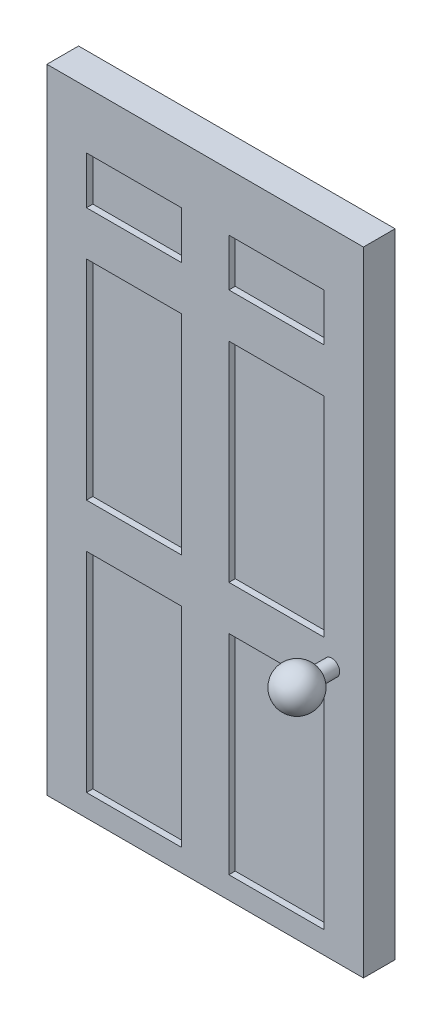
ISO-10303-21;
HEADER;
FILE_DESCRIPTION(('STEP AP214'),'2;1');
FILE_NAME('part.step','',(''),(''),'','','');
FILE_SCHEMA(('AUTOMOTIVE_DESIGN { 1 0 10303 214 1 1 1 1 }'));
ENDSEC;
DATA;
#1=APPLICATION_CONTEXT('core data for automotive mechanical design processes');
#2=APPLICATION_PROTOCOL_DEFINITION('international standard','automotive_design',2000,#1);
#3=PRODUCT_CONTEXT('',#1,'mechanical');
#4=PRODUCT('Part','Part','',(#3));
#5=PRODUCT_RELATED_PRODUCT_CATEGORY('part','',(#4));
#6=PRODUCT_DEFINITION_FORMATION('','',#4);
#7=PRODUCT_DEFINITION_CONTEXT('part definition',#1,'design');
#8=PRODUCT_DEFINITION('design','',#6,#7);
#9=PRODUCT_DEFINITION_SHAPE('','',#8);
#10=(LENGTH_UNIT() NAMED_UNIT(*) SI_UNIT(.MILLI.,.METRE.));
#11=(NAMED_UNIT(*) PLANE_ANGLE_UNIT() SI_UNIT($,.RADIAN.));
#12=(NAMED_UNIT(*) SI_UNIT($,.STERADIAN.) SOLID_ANGLE_UNIT());
#13=UNCERTAINTY_MEASURE_WITH_UNIT(LENGTH_MEASURE(1.E-05),#10,'distance_accuracy_value','');
#14=(GEOMETRIC_REPRESENTATION_CONTEXT(3) GLOBAL_UNCERTAINTY_ASSIGNED_CONTEXT((#13)) GLOBAL_UNIT_ASSIGNED_CONTEXT((#10,
#11,#12)) REPRESENTATION_CONTEXT('',''));
#15=CARTESIAN_POINT('',(0.,0.,0.));
#16=DIRECTION('',(0.,0.,1.));
#17=DIRECTION('',(1.,0.,0.));
#18=AXIS2_PLACEMENT_3D('',#15,#16,#17);
#19=CARTESIAN_POINT('',(25.,50.,2.5));
#20=DIRECTION('',(-1.,0.,0.));
#21=DIRECTION('',(0.,-1.,0.));
#22=AXIS2_PLACEMENT_3D('',#19,#20,#21);
#23=PLANE('',#22);
#24=DIRECTION('',(0.,1.,0.));
#25=VECTOR('',#24,1.);
#26=CARTESIAN_POINT('',(25.,50.,-2.5));
#27=LINE('',#26,#25);
#28=CARTESIAN_POINT('',(25.,-50.,-2.5));
#29=VERTEX_POINT('',#28);
#30=CARTESIAN_POINT('',(25.,50.,-2.5));
#31=VERTEX_POINT('',#30);
#32=EDGE_CURVE('E499',#29,#31,#27,.T.);
#33=ORIENTED_EDGE('',*,*,#32,.T.);
#34=DIRECTION('',(0.,0.,-1.));
#35=VECTOR('',#34,1.);
#36=CARTESIAN_POINT('',(25.,50.,2.5));
#37=LINE('',#36,#35);
#38=CARTESIAN_POINT('',(25.,50.,2.5));
#39=VERTEX_POINT('',#38);
#40=EDGE_CURVE('E11',#39,#31,#37,.T.);
#41=ORIENTED_EDGE('',*,*,#40,.F.);
#42=DIRECTION('',(0.,1.,0.));
#43=VECTOR('',#42,1.);
#44=CARTESIAN_POINT('',(25.,50.,2.5));
#45=LINE('',#44,#43);
#46=CARTESIAN_POINT('',(25.,-50.,2.5));
#47=VERTEX_POINT('',#46);
#48=EDGE_CURVE('E503',#47,#39,#45,.T.);
#49=ORIENTED_EDGE('',*,*,#48,.F.);
#50=DIRECTION('',(0.,0.,-1.));
#51=VECTOR('',#50,1.);
#52=CARTESIAN_POINT('',(25.,-50.,2.5));
#53=LINE('',#52,#51);
#54=EDGE_CURVE('E517',#47,#29,#53,.T.);
#55=ORIENTED_EDGE('',*,*,#54,.T.);
#56=EDGE_LOOP('',(#33,#41,#49,#55));
#57=FACE_BOUND('',#56,.T.);
#58=ADVANCED_FACE('F39',(#57),#23,.F.);
#59=CARTESIAN_POINT('',(-25.,50.,2.5));
#60=DIRECTION('',(0.,-1.,0.));
#61=DIRECTION('',(0.,0.,-1.));
#62=AXIS2_PLACEMENT_3D('',#59,#60,#61);
#63=PLANE('',#62);
#64=DIRECTION('',(-1.,0.,0.));
#65=VECTOR('',#64,1.);
#66=CARTESIAN_POINT('',(-25.,50.,-2.5));
#67=LINE('',#66,#65);
#68=CARTESIAN_POINT('',(-25.,50.,-2.5));
#69=VERTEX_POINT('',#68);
#70=EDGE_CURVE('E521',#31,#69,#67,.T.);
#71=ORIENTED_EDGE('',*,*,#70,.T.);
#72=DIRECTION('',(0.,0.,-1.));
#73=VECTOR('',#72,1.);
#74=CARTESIAN_POINT('',(-25.,50.,2.5));
#75=LINE('',#74,#73);
#76=CARTESIAN_POINT('',(-25.,50.,2.5));
#77=VERTEX_POINT('',#76);
#78=EDGE_CURVE('E47',#77,#69,#75,.T.);
#79=ORIENTED_EDGE('',*,*,#78,.F.);
#80=DIRECTION('',(-1.,0.,0.));
#81=VECTOR('',#80,1.);
#82=CARTESIAN_POINT('',(-25.,50.,2.5));
#83=LINE('',#82,#81);
#84=EDGE_CURVE('E507',#39,#77,#83,.T.);
#85=ORIENTED_EDGE('',*,*,#84,.F.);
#86=ORIENTED_EDGE('',*,*,#40,.T.);
#87=EDGE_LOOP('',(#71,#79,#85,#86));
#88=FACE_BOUND('',#87,.T.);
#89=ADVANCED_FACE('F557',(#88),#63,.F.);
#90=CARTESIAN_POINT('',(-25.,50.,2.5));
#91=DIRECTION('',(1.,0.,0.));
#92=DIRECTION('',(0.,1.,0.));
#93=AXIS2_PLACEMENT_3D('',#90,#91,#92);
#94=PLANE('',#93);
#95=DIRECTION('',(0.,-1.,0.));
#96=VECTOR('',#95,1.);
#97=CARTESIAN_POINT('',(-25.,50.,-2.5));
#98=LINE('',#97,#96);
#99=CARTESIAN_POINT('',(-25.,-50.,-2.5));
#100=VERTEX_POINT('',#99);
#101=EDGE_CURVE('E524',#69,#100,#98,.T.);
#102=ORIENTED_EDGE('',*,*,#101,.T.);
#103=DIRECTION('',(0.,0.,-1.));
#104=VECTOR('',#103,1.);
#105=CARTESIAN_POINT('',(-25.,-50.,2.5));
#106=LINE('',#105,#104);
#107=CARTESIAN_POINT('',(-25.,-50.,2.5));
#108=VERTEX_POINT('',#107);
#109=EDGE_CURVE('E532',#108,#100,#106,.T.);
#110=ORIENTED_EDGE('',*,*,#109,.F.);
#111=DIRECTION('',(0.,-1.,0.));
#112=VECTOR('',#111,1.);
#113=CARTESIAN_POINT('',(-25.,50.,2.5));
#114=LINE('',#113,#112);
#115=EDGE_CURVE('E511',#77,#108,#114,.T.);
#116=ORIENTED_EDGE('',*,*,#115,.F.);
#117=ORIENTED_EDGE('',*,*,#78,.T.);
#118=EDGE_LOOP('',(#102,#110,#116,#117));
#119=FACE_BOUND('',#118,.T.);
#120=ADVANCED_FACE('F541',(#119),#94,.F.);
#121=CARTESIAN_POINT('',(-25.,-50.,2.5));
#122=DIRECTION('',(0.,1.,0.));
#123=DIRECTION('',(0.,0.,1.));
#124=AXIS2_PLACEMENT_3D('',#121,#122,#123);
#125=PLANE('',#124);
#126=DIRECTION('',(1.,0.,0.));
#127=VECTOR('',#126,1.);
#128=CARTESIAN_POINT('',(-25.,-50.,-2.5));
#129=LINE('',#128,#127);
#130=EDGE_CURVE('E508',#100,#29,#129,.T.);
#131=ORIENTED_EDGE('',*,*,#130,.T.);
#132=ORIENTED_EDGE('',*,*,#54,.F.);
#133=DIRECTION('',(1.,0.,0.));
#134=VECTOR('',#133,1.);
#135=CARTESIAN_POINT('',(-25.,-50.,2.5));
#136=LINE('',#135,#134);
#137=EDGE_CURVE('E514',#108,#47,#136,.T.);
#138=ORIENTED_EDGE('',*,*,#137,.F.);
#139=ORIENTED_EDGE('',*,*,#109,.T.);
#140=EDGE_LOOP('',(#131,#132,#138,#139));
#141=FACE_BOUND('',#140,.T.);
#142=ADVANCED_FACE('F550',(#141),#125,.F.);
#143=CARTESIAN_POINT('',(0.,0.,2.5));
#144=DIRECTION('',(0.,0.,1.));
#145=DIRECTION('',(1.,0.,0.));
#146=AXIS2_PLACEMENT_3D('',#143,#144,#145);
#147=PLANE('',#146);
#148=DIRECTION('',(0.,-1.,0.));
#149=VECTOR('',#148,1.);
#150=CARTESIAN_POINT('',(3.74999999999998,41.,2.5));
#151=LINE('',#150,#149);
#152=CARTESIAN_POINT('',(3.74999999999998,41.,2.5));
#153=VERTEX_POINT('',#152);
#154=CARTESIAN_POINT('',(3.74999999999998,33.5,2.5));
#155=VERTEX_POINT('',#154);
#156=EDGE_CURVE('E54',#153,#155,#151,.T.);
#157=ORIENTED_EDGE('',*,*,#156,.F.);
#158=DIRECTION('',(-1.,0.,0.));
#159=VECTOR('',#158,1.);
#160=CARTESIAN_POINT('',(3.74999999999998,41.,2.5));
#161=LINE('',#160,#159);
#162=CARTESIAN_POINT('',(18.75,41.,2.5));
#163=VERTEX_POINT('',#162);
#164=EDGE_CURVE('E284',#163,#153,#161,.T.);
#165=ORIENTED_EDGE('',*,*,#164,.F.);
#166=DIRECTION('',(0.,1.,0.));
#167=VECTOR('',#166,1.);
#168=CARTESIAN_POINT('',(18.75,41.,2.5));
#169=LINE('',#168,#167);
#170=CARTESIAN_POINT('',(18.75,33.5,2.5));
#171=VERTEX_POINT('',#170);
#172=EDGE_CURVE('E304',#171,#163,#169,.T.);
#173=ORIENTED_EDGE('',*,*,#172,.F.);
#174=DIRECTION('',(1.,0.,0.));
#175=VECTOR('',#174,1.);
#176=CARTESIAN_POINT('',(3.74999999999998,33.5,2.5));
#177=LINE('',#176,#175);
#178=EDGE_CURVE('E299',#155,#171,#177,.T.);
#179=ORIENTED_EDGE('',*,*,#178,.F.);
#180=EDGE_LOOP('',(#157,#165,#173,#179));
#181=FACE_BOUND('',#180,.T.);
#182=DIRECTION('',(0.,-1.,0.));
#183=VECTOR('',#182,1.);
#184=CARTESIAN_POINT('',(3.74999999999999,26.5,2.5));
#185=LINE('',#184,#183);
#186=CARTESIAN_POINT('',(3.74999999999999,26.5,2.5));
#187=VERTEX_POINT('',#186);
#188=CARTESIAN_POINT('',(3.75,-6.5,2.5));
#189=VERTEX_POINT('',#188);
#190=EDGE_CURVE('E62',#187,#189,#185,.T.);
#191=ORIENTED_EDGE('',*,*,#190,.F.);
#192=DIRECTION('',(-1.,0.,0.));
#193=VECTOR('',#192,1.);
#194=CARTESIAN_POINT('',(3.74999999999999,26.5,2.5));
#195=LINE('',#194,#193);
#196=CARTESIAN_POINT('',(18.75,26.5,2.5));
#197=VERTEX_POINT('',#196);
#198=EDGE_CURVE('E328',#197,#187,#195,.T.);
#199=ORIENTED_EDGE('',*,*,#198,.F.);
#200=DIRECTION('',(0.,1.,0.));
#201=VECTOR('',#200,1.);
#202=CARTESIAN_POINT('',(18.75,26.5,2.5));
#203=LINE('',#202,#201);
#204=CARTESIAN_POINT('',(18.75,-6.49999999999999,2.5));
#205=VERTEX_POINT('',#204);
#206=EDGE_CURVE('E348',#205,#197,#203,.T.);
#207=ORIENTED_EDGE('',*,*,#206,.F.);
#208=DIRECTION('',(1.,0.,0.));
#209=VECTOR('',#208,1.);
#210=CARTESIAN_POINT('',(3.75,-6.5,2.5));
#211=LINE('',#210,#209);
#212=EDGE_CURVE('E343',#189,#205,#211,.T.);
#213=ORIENTED_EDGE('',*,*,#212,.F.);
#214=EDGE_LOOP('',(#191,#199,#207,#213));
#215=FACE_BOUND('',#214,.T.);
#216=DIRECTION('',(0.,1.,0.));
#217=VECTOR('',#216,1.);
#218=CARTESIAN_POINT('',(-3.75,26.5,2.5));
#219=LINE('',#218,#217);
#220=CARTESIAN_POINT('',(-3.75,-6.5,2.5));
#221=VERTEX_POINT('',#220);
#222=CARTESIAN_POINT('',(-3.75,26.5,2.5));
#223=VERTEX_POINT('',#222);
#224=EDGE_CURVE('E383',#221,#223,#219,.T.);
#225=ORIENTED_EDGE('',*,*,#224,.F.);
#226=DIRECTION('',(1.,0.,0.));
#227=VECTOR('',#226,1.);
#228=CARTESIAN_POINT('',(-3.75,-6.5,2.5));
#229=LINE('',#228,#227);
#230=CARTESIAN_POINT('',(-18.75,-6.50000000000001,2.5));
#231=VERTEX_POINT('',#230);
#232=EDGE_CURVE('E370',#231,#221,#229,.T.);
#233=ORIENTED_EDGE('',*,*,#232,.F.);
#234=DIRECTION('',(0.,-1.,0.));
#235=VECTOR('',#234,1.);
#236=CARTESIAN_POINT('',(-18.75,26.5,2.5));
#237=LINE('',#236,#235);
#238=CARTESIAN_POINT('',(-18.75,26.5,2.5));
#239=VERTEX_POINT('',#238);
#240=EDGE_CURVE('E391',#239,#231,#237,.T.);
#241=ORIENTED_EDGE('',*,*,#240,.F.);
#242=DIRECTION('',(-1.,0.,0.));
#243=VECTOR('',#242,1.);
#244=CARTESIAN_POINT('',(-3.75,26.5,2.5));
#245=LINE('',#244,#243);
#246=EDGE_CURVE('E386',#223,#239,#245,.T.);
#247=ORIENTED_EDGE('',*,*,#246,.F.);
#248=EDGE_LOOP('',(#225,#233,#241,#247));
#249=FACE_BOUND('',#248,.T.);
#250=DIRECTION('',(0.,1.,0.));
#251=VECTOR('',#250,1.);
#252=CARTESIAN_POINT('',(-3.75,-13.5,2.5));
#253=LINE('',#252,#251);
#254=CARTESIAN_POINT('',(-3.74999999999999,-46.5,2.5));
#255=VERTEX_POINT('',#254);
#256=CARTESIAN_POINT('',(-3.75,-13.5,2.5));
#257=VERTEX_POINT('',#256);
#258=EDGE_CURVE('E273',#255,#257,#253,.T.);
#259=ORIENTED_EDGE('',*,*,#258,.F.);
#260=DIRECTION('',(1.,0.,0.));
#261=VECTOR('',#260,1.);
#262=CARTESIAN_POINT('',(-3.74999999999999,-46.5,2.5));
#263=LINE('',#262,#261);
#264=CARTESIAN_POINT('',(-18.75,-46.5,2.5));
#265=VERTEX_POINT('',#264);
#266=EDGE_CURVE('E414',#265,#255,#263,.T.);
#267=ORIENTED_EDGE('',*,*,#266,.F.);
#268=DIRECTION('',(0.,-1.,0.));
#269=VECTOR('',#268,1.);
#270=CARTESIAN_POINT('',(-18.75,-13.5,2.5));
#271=LINE('',#270,#269);
#272=CARTESIAN_POINT('',(-18.75,-13.5,2.5));
#273=VERTEX_POINT('',#272);
#274=EDGE_CURVE('E433',#273,#265,#271,.T.);
#275=ORIENTED_EDGE('',*,*,#274,.F.);
#276=DIRECTION('',(-1.,0.,0.));
#277=VECTOR('',#276,1.);
#278=CARTESIAN_POINT('',(-3.75,-13.5,2.5));
#279=LINE('',#278,#277);
#280=EDGE_CURVE('E429',#257,#273,#279,.T.);
#281=ORIENTED_EDGE('',*,*,#280,.F.);
#282=EDGE_LOOP('',(#259,#267,#275,#281));
#283=FACE_BOUND('',#282,.T.);
#284=DIRECTION('',(0.,-1.,0.));
#285=VECTOR('',#284,1.);
#286=CARTESIAN_POINT('',(3.75000000000001,-13.5,2.5));
#287=LINE('',#286,#285);
#288=CARTESIAN_POINT('',(3.75000000000001,-13.5,2.5));
#289=VERTEX_POINT('',#288);
#290=CARTESIAN_POINT('',(3.75000000000002,-46.5,2.5));
#291=VERTEX_POINT('',#290);
#292=EDGE_CURVE('E231',#289,#291,#287,.T.);
#293=ORIENTED_EDGE('',*,*,#292,.F.);
#294=DIRECTION('',(-1.,0.,0.));
#295=VECTOR('',#294,1.);
#296=CARTESIAN_POINT('',(3.75000000000001,-13.5,2.5));
#297=LINE('',#296,#295);
#298=CARTESIAN_POINT('',(18.75,-13.5,2.5));
#299=VERTEX_POINT('',#298);
#300=EDGE_CURVE('E251',#299,#289,#297,.T.);
#301=ORIENTED_EDGE('',*,*,#300,.F.);
#302=DIRECTION('',(0.,1.,0.));
#303=VECTOR('',#302,1.);
#304=CARTESIAN_POINT('',(18.75,-13.5,2.5));
#305=LINE('',#304,#303);
#306=CARTESIAN_POINT('',(18.75,-46.5,2.5));
#307=VERTEX_POINT('',#306);
#308=EDGE_CURVE('E255',#307,#299,#305,.T.);
#309=ORIENTED_EDGE('',*,*,#308,.F.);
#310=DIRECTION('',(1.,0.,0.));
#311=VECTOR('',#310,1.);
#312=CARTESIAN_POINT('',(3.75000000000002,-46.5,2.5));
#313=LINE('',#312,#311);
#314=EDGE_CURVE('E264',#291,#307,#313,.T.);
#315=ORIENTED_EDGE('',*,*,#314,.F.);
#316=EDGE_LOOP('',(#293,#301,#309,#315));
#317=FACE_BOUND('',#316,.T.);
#318=DIRECTION('',(0.,1.,0.));
#319=VECTOR('',#318,1.);
#320=CARTESIAN_POINT('',(-3.75,41.,2.5));
#321=LINE('',#320,#319);
#322=CARTESIAN_POINT('',(-3.75,33.5,2.5));
#323=VERTEX_POINT('',#322);
#324=CARTESIAN_POINT('',(-3.75,41.,2.5));
#325=VERTEX_POINT('',#324);
#326=EDGE_CURVE('E314',#323,#325,#321,.T.);
#327=ORIENTED_EDGE('',*,*,#326,.F.);
#328=DIRECTION('',(1.,0.,0.));
#329=VECTOR('',#328,1.);
#330=CARTESIAN_POINT('',(-3.75,33.5,2.5));
#331=LINE('',#330,#329);
#332=CARTESIAN_POINT('',(-18.75,33.5,2.5));
#333=VERTEX_POINT('',#332);
#334=EDGE_CURVE('E456',#333,#323,#331,.T.);
#335=ORIENTED_EDGE('',*,*,#334,.F.);
#336=DIRECTION('',(0.,-1.,0.));
#337=VECTOR('',#336,1.);
#338=CARTESIAN_POINT('',(-18.75,41.,2.5));
#339=LINE('',#338,#337);
#340=CARTESIAN_POINT('',(-18.75,41.,2.5));
#341=VERTEX_POINT('',#340);
#342=EDGE_CURVE('E475',#341,#333,#339,.T.);
#343=ORIENTED_EDGE('',*,*,#342,.F.);
#344=DIRECTION('',(-1.,0.,0.));
#345=VECTOR('',#344,1.);
#346=CARTESIAN_POINT('',(-3.75,41.,2.5));
#347=LINE('',#346,#345);
#348=EDGE_CURVE('E471',#325,#341,#347,.T.);
#349=ORIENTED_EDGE('',*,*,#348,.F.);
#350=EDGE_LOOP('',(#327,#335,#343,#349));
#351=FACE_BOUND('',#350,.T.);
#352=CARTESIAN_POINT('',(20.,-10.,2.5));
#353=DIRECTION('',(0.,0.,1.));
#354=DIRECTION('',(1.,0.,0.));
#355=AXIS2_PLACEMENT_3D('',#352,#353,#354);
#356=CIRCLE('',#355,1.25);
#357=CARTESIAN_POINT('',(21.25,-10.,2.5));
#358=VERTEX_POINT('',#357);
#359=EDGE_CURVE('E485',#358,#358,#356,.T.);
#360=ORIENTED_EDGE('',*,*,#359,.F.);
#361=EDGE_LOOP('',(#360));
#362=FACE_BOUND('',#361,.T.);
#363=ORIENTED_EDGE('',*,*,#48,.T.);
#364=ORIENTED_EDGE('',*,*,#84,.T.);
#365=ORIENTED_EDGE('',*,*,#115,.T.);
#366=ORIENTED_EDGE('',*,*,#137,.T.);
#367=EDGE_LOOP('',(#363,#364,#365,#366));
#368=FACE_BOUND('',#367,.T.);
#369=ADVANCED_FACE('F556',(#181,#215,#249,#283,#317,#351,#362,#368),#147,.T.);
#370=CARTESIAN_POINT('',(0.,0.,-2.5));
#371=DIRECTION('',(0.,0.,1.));
#372=DIRECTION('',(1.,0.,0.));
#373=AXIS2_PLACEMENT_3D('',#370,#371,#372);
#374=PLANE('',#373);
#375=ORIENTED_EDGE('',*,*,#32,.F.);
#376=ORIENTED_EDGE('',*,*,#130,.F.);
#377=ORIENTED_EDGE('',*,*,#101,.F.);
#378=ORIENTED_EDGE('',*,*,#70,.F.);
#379=EDGE_LOOP('',(#375,#376,#377,#378));
#380=FACE_BOUND('',#379,.T.);
#381=ADVANCED_FACE('F547',(#380),#374,.F.);
#382=CARTESIAN_POINT('',(20.,-10.,5.));
#383=DIRECTION('',(0.,0.,-1.));
#384=DIRECTION('',(-1.,0.,0.));
#385=AXIS2_PLACEMENT_3D('',#382,#383,#384);
#386=CYLINDRICAL_SURFACE('',#385,1.25);
#387=CARTESIAN_POINT('',(20.,-10.,5.));
#388=DIRECTION('',(0.,0.,1.));
#389=DIRECTION('',(1.,0.,0.));
#390=AXIS2_PLACEMENT_3D('',#387,#388,#389);
#391=CIRCLE('',#390,1.25);
#392=CARTESIAN_POINT('',(21.25,-10.,5.));
#393=VERTEX_POINT('',#392);
#394=EDGE_CURVE('E495',#393,#393,#391,.T.);
#395=ORIENTED_EDGE('',*,*,#394,.F.);
#396=EDGE_LOOP('',(#395));
#397=FACE_BOUND('',#396,.T.);
#398=ORIENTED_EDGE('',*,*,#359,.T.);
#399=EDGE_LOOP('',(#398));
#400=FACE_BOUND('',#399,.T.);
#401=ADVANCED_FACE('F569',(#397,#400),#386,.T.);
#402=CARTESIAN_POINT('',(20.,-10.,8.));
#403=DIRECTION('',(0.,1.,0.));
#404=DIRECTION('',(0.,0.,1.));
#405=AXIS2_PLACEMENT_3D('',#402,#403,#404);
#406=SPHERICAL_SURFACE('',#405,3.25);
#407=CARTESIAN_POINT('',(20.,-10.,8.));
#408=DIRECTION('',(0.,0.,1.));
#409=DIRECTION('',(1.,0.,0.));
#410=AXIS2_PLACEMENT_3D('',#407,#408,#409);
#411=SPHERICAL_SURFACE('',#410,3.25);
#412=ORIENTED_EDGE('',*,*,#394,.T.);
#413=EDGE_LOOP('',(#412));
#414=FACE_BOUND('',#413,.T.);
#415=ADVANCED_FACE('F575',(#414),#411,.T.);
#416=CARTESIAN_POINT('',(-3.75,41.,1.5));
#417=DIRECTION('',(1.,0.,0.));
#418=DIRECTION('',(0.,1.,0.));
#419=AXIS2_PLACEMENT_3D('',#416,#417,#418);
#420=PLANE('',#419);
#421=ORIENTED_EDGE('',*,*,#326,.T.);
#422=DIRECTION('',(0.,0.,1.));
#423=VECTOR('',#422,1.);
#424=CARTESIAN_POINT('',(-3.75,41.,1.5));
#425=LINE('',#424,#423);
#426=CARTESIAN_POINT('',(-3.75,41.,1.5));
#427=VERTEX_POINT('',#426);
#428=EDGE_CURVE('E468',#427,#325,#425,.T.);
#429=ORIENTED_EDGE('',*,*,#428,.F.);
#430=DIRECTION('',(0.,1.,0.));
#431=VECTOR('',#430,1.);
#432=CARTESIAN_POINT('',(-3.75,41.,1.5));
#433=LINE('',#432,#431);
#434=CARTESIAN_POINT('',(-3.75,33.5,1.5));
#435=VERTEX_POINT('',#434);
#436=EDGE_CURVE('E451',#435,#427,#433,.T.);
#437=ORIENTED_EDGE('',*,*,#436,.F.);
#438=DIRECTION('',(0.,0.,1.));
#439=VECTOR('',#438,1.);
#440=CARTESIAN_POINT('',(-3.75,33.5,1.5));
#441=LINE('',#440,#439);
#442=EDGE_CURVE('E482',#435,#323,#441,.T.);
#443=ORIENTED_EDGE('',*,*,#442,.T.);
#444=EDGE_LOOP('',(#421,#429,#437,#443));
#445=FACE_BOUND('',#444,.T.);
#446=ADVANCED_FACE('F579',(#445),#420,.F.);
#447=CARTESIAN_POINT('',(-3.75,33.5,1.5));
#448=DIRECTION('',(0.,-1.,0.));
#449=DIRECTION('',(0.,0.,-1.));
#450=AXIS2_PLACEMENT_3D('',#447,#448,#449);
#451=PLANE('',#450);
#452=ORIENTED_EDGE('',*,*,#334,.T.);
#453=ORIENTED_EDGE('',*,*,#442,.F.);
#454=DIRECTION('',(1.,0.,0.));
#455=VECTOR('',#454,1.);
#456=CARTESIAN_POINT('',(-3.75,33.5,1.5));
#457=LINE('',#456,#455);
#458=CARTESIAN_POINT('',(-18.75,33.5,1.5));
#459=VERTEX_POINT('',#458);
#460=EDGE_CURVE('E464',#459,#435,#457,.T.);
#461=ORIENTED_EDGE('',*,*,#460,.F.);
#462=DIRECTION('',(0.,0.,1.));
#463=VECTOR('',#462,1.);
#464=CARTESIAN_POINT('',(-18.75,33.5,1.5));
#465=LINE('',#464,#463);
#466=EDGE_CURVE('E486',#459,#333,#465,.T.);
#467=ORIENTED_EDGE('',*,*,#466,.T.);
#468=EDGE_LOOP('',(#452,#453,#461,#467));
#469=FACE_BOUND('',#468,.T.);
#470=ADVANCED_FACE('F583',(#469),#451,.F.);
#471=CARTESIAN_POINT('',(-18.75,41.,1.5));
#472=DIRECTION('',(-1.,0.,0.));
#473=DIRECTION('',(0.,0.,1.));
#474=AXIS2_PLACEMENT_3D('',#471,#472,#473);
#475=PLANE('',#474);
#476=ORIENTED_EDGE('',*,*,#342,.T.);
#477=ORIENTED_EDGE('',*,*,#466,.F.);
#478=DIRECTION('',(0.,-1.,0.));
#479=VECTOR('',#478,1.);
#480=CARTESIAN_POINT('',(-18.75,41.,1.5));
#481=LINE('',#480,#479);
#482=CARTESIAN_POINT('',(-18.75,41.,1.5));
#483=VERTEX_POINT('',#482);
#484=EDGE_CURVE('E460',#483,#459,#481,.T.);
#485=ORIENTED_EDGE('',*,*,#484,.F.);
#486=DIRECTION('',(0.,0.,1.));
#487=VECTOR('',#486,1.);
#488=CARTESIAN_POINT('',(-18.75,41.,1.5));
#489=LINE('',#488,#487);
#490=EDGE_CURVE('E489',#483,#341,#489,.T.);
#491=ORIENTED_EDGE('',*,*,#490,.T.);
#492=EDGE_LOOP('',(#476,#477,#485,#491));
#493=FACE_BOUND('',#492,.T.);
#494=ADVANCED_FACE('F589',(#493),#475,.F.);
#495=CARTESIAN_POINT('',(-3.75,41.,1.5));
#496=DIRECTION('',(0.,1.,0.));
#497=DIRECTION('',(-1.,0.,0.));
#498=AXIS2_PLACEMENT_3D('',#495,#496,#497);
#499=PLANE('',#498);
#500=ORIENTED_EDGE('',*,*,#348,.T.);
#501=ORIENTED_EDGE('',*,*,#490,.F.);
#502=DIRECTION('',(-1.,0.,0.));
#503=VECTOR('',#502,1.);
#504=CARTESIAN_POINT('',(-3.75,41.,1.5));
#505=LINE('',#504,#503);
#506=EDGE_CURVE('E455',#427,#483,#505,.T.);
#507=ORIENTED_EDGE('',*,*,#506,.F.);
#508=ORIENTED_EDGE('',*,*,#428,.T.);
#509=EDGE_LOOP('',(#500,#501,#507,#508));
#510=FACE_BOUND('',#509,.T.);
#511=ADVANCED_FACE('F585',(#510),#499,.F.);
#512=CARTESIAN_POINT('',(0.,0.,1.5));
#513=DIRECTION('',(0.,0.,-1.));
#514=DIRECTION('',(-1.,0.,0.));
#515=AXIS2_PLACEMENT_3D('',#512,#513,#514);
#516=PLANE('',#515);
#517=ORIENTED_EDGE('',*,*,#436,.T.);
#518=ORIENTED_EDGE('',*,*,#506,.T.);
#519=ORIENTED_EDGE('',*,*,#484,.T.);
#520=ORIENTED_EDGE('',*,*,#460,.T.);
#521=EDGE_LOOP('',(#517,#518,#519,#520));
#522=FACE_BOUND('',#521,.T.);
#523=ADVANCED_FACE('F588',(#522),#516,.F.);
#524=CARTESIAN_POINT('',(3.75000000000001,-13.5,1.5));
#525=DIRECTION('',(-1.,0.,0.));
#526=DIRECTION('',(0.,-1.,0.));
#527=AXIS2_PLACEMENT_3D('',#524,#525,#526);
#528=PLANE('',#527);
#529=ORIENTED_EDGE('',*,*,#292,.T.);
#530=DIRECTION('',(0.,0.,1.));
#531=VECTOR('',#530,1.);
#532=CARTESIAN_POINT('',(3.75000000000002,-46.5,1.5));
#533=LINE('',#532,#531);
#534=CARTESIAN_POINT('',(3.75000000000002,-46.5,1.5));
#535=VERTEX_POINT('',#534);
#536=EDGE_CURVE('E224',#535,#291,#533,.T.);
#537=ORIENTED_EDGE('',*,*,#536,.F.);
#538=DIRECTION('',(0.,-1.,0.));
#539=VECTOR('',#538,1.);
#540=CARTESIAN_POINT('',(3.75000000000001,-13.5,1.5));
#541=LINE('',#540,#539);
#542=CARTESIAN_POINT('',(3.75000000000001,-13.5,1.5));
#543=VERTEX_POINT('',#542);
#544=EDGE_CURVE('E228',#543,#535,#541,.T.);
#545=ORIENTED_EDGE('',*,*,#544,.F.);
#546=DIRECTION('',(0.,0.,1.));
#547=VECTOR('',#546,1.);
#548=CARTESIAN_POINT('',(3.75000000000001,-13.5,1.5));
#549=LINE('',#548,#547);
#550=EDGE_CURVE('E270',#543,#289,#549,.T.);
#551=ORIENTED_EDGE('',*,*,#550,.T.);
#552=EDGE_LOOP('',(#529,#537,#545,#551));
#553=FACE_BOUND('',#552,.T.);
#554=ADVANCED_FACE('F226',(#553),#528,.F.);
#555=CARTESIAN_POINT('',(3.75000000000001,-13.5,1.5));
#556=DIRECTION('',(0.,1.,0.));
#557=DIRECTION('',(-1.,0.,0.));
#558=AXIS2_PLACEMENT_3D('',#555,#556,#557);
#559=PLANE('',#558);
#560=ORIENTED_EDGE('',*,*,#300,.T.);
#561=ORIENTED_EDGE('',*,*,#550,.F.);
#562=DIRECTION('',(-1.,0.,0.));
#563=VECTOR('',#562,1.);
#564=CARTESIAN_POINT('',(3.75000000000001,-13.5,1.5));
#565=LINE('',#564,#563);
#566=CARTESIAN_POINT('',(18.75,-13.5,1.5));
#567=VERTEX_POINT('',#566);
#568=EDGE_CURVE('E237',#567,#543,#565,.T.);
#569=ORIENTED_EDGE('',*,*,#568,.F.);
#570=DIRECTION('',(0.,0.,1.));
#571=VECTOR('',#570,1.);
#572=CARTESIAN_POINT('',(18.75,-13.5,1.5));
#573=LINE('',#572,#571);
#574=EDGE_CURVE('E274',#567,#299,#573,.T.);
#575=ORIENTED_EDGE('',*,*,#574,.T.);
#576=EDGE_LOOP('',(#560,#561,#569,#575));
#577=FACE_BOUND('',#576,.T.);
#578=ADVANCED_FACE('F680',(#577),#559,.F.);
#579=CARTESIAN_POINT('',(18.75,-13.5,1.5));
#580=DIRECTION('',(1.,0.,0.));
#581=DIRECTION('',(0.,1.,0.));
#582=AXIS2_PLACEMENT_3D('',#579,#580,#581);
#583=PLANE('',#582);
#584=ORIENTED_EDGE('',*,*,#308,.T.);
#585=ORIENTED_EDGE('',*,*,#574,.F.);
#586=DIRECTION('',(0.,1.,0.));
#587=VECTOR('',#586,1.);
#588=CARTESIAN_POINT('',(18.75,-13.5,1.5));
#589=LINE('',#588,#587);
#590=CARTESIAN_POINT('',(18.75,-46.5,1.5));
#591=VERTEX_POINT('',#590);
#592=EDGE_CURVE('E246',#591,#567,#589,.T.);
#593=ORIENTED_EDGE('',*,*,#592,.F.);
#594=DIRECTION('',(0.,0.,1.));
#595=VECTOR('',#594,1.);
#596=CARTESIAN_POINT('',(18.75,-46.5,1.5));
#597=LINE('',#596,#595);
#598=EDGE_CURVE('E236',#591,#307,#597,.T.);
#599=ORIENTED_EDGE('',*,*,#598,.T.);
#600=EDGE_LOOP('',(#584,#585,#593,#599));
#601=FACE_BOUND('',#600,.T.);
#602=ADVANCED_FACE('F683',(#601),#583,.F.);
#603=CARTESIAN_POINT('',(3.75000000000002,-46.5,1.5));
#604=DIRECTION('',(0.,-1.,0.));
#605=DIRECTION('',(1.,0.,0.));
#606=AXIS2_PLACEMENT_3D('',#603,#604,#605);
#607=PLANE('',#606);
#608=ORIENTED_EDGE('',*,*,#314,.T.);
#609=ORIENTED_EDGE('',*,*,#598,.F.);
#610=DIRECTION('',(1.,0.,0.));
#611=VECTOR('',#610,1.);
#612=CARTESIAN_POINT('',(3.75000000000002,-46.5,1.5));
#613=LINE('',#612,#611);
#614=EDGE_CURVE('E240',#535,#591,#613,.T.);
#615=ORIENTED_EDGE('',*,*,#614,.F.);
#616=ORIENTED_EDGE('',*,*,#536,.T.);
#617=EDGE_LOOP('',(#608,#609,#615,#616));
#618=FACE_BOUND('',#617,.T.);
#619=ADVANCED_FACE('F241',(#618),#607,.F.);
#620=CARTESIAN_POINT('',(0.,0.,1.5));
#621=DIRECTION('',(0.,0.,1.));
#622=DIRECTION('',(1.,0.,0.));
#623=AXIS2_PLACEMENT_3D('',#620,#621,#622);
#624=PLANE('',#623);
#625=ORIENTED_EDGE('',*,*,#544,.T.);
#626=ORIENTED_EDGE('',*,*,#614,.T.);
#627=ORIENTED_EDGE('',*,*,#592,.T.);
#628=ORIENTED_EDGE('',*,*,#568,.T.);
#629=EDGE_LOOP('',(#625,#626,#627,#628));
#630=FACE_BOUND('',#629,.T.);
#631=ADVANCED_FACE('F248',(#630),#624,.T.);
#632=CARTESIAN_POINT('',(-3.75,-13.5,1.5));
#633=DIRECTION('',(1.,0.,0.));
#634=DIRECTION('',(0.,1.,0.));
#635=AXIS2_PLACEMENT_3D('',#632,#633,#634);
#636=PLANE('',#635);
#637=ORIENTED_EDGE('',*,*,#258,.T.);
#638=DIRECTION('',(0.,0.,1.));
#639=VECTOR('',#638,1.);
#640=CARTESIAN_POINT('',(-3.75,-13.5,1.5));
#641=LINE('',#640,#639);
#642=CARTESIAN_POINT('',(-3.75,-13.5,1.5));
#643=VERTEX_POINT('',#642);
#644=EDGE_CURVE('E426',#643,#257,#641,.T.);
#645=ORIENTED_EDGE('',*,*,#644,.F.);
#646=DIRECTION('',(0.,1.,0.));
#647=VECTOR('',#646,1.);
#648=CARTESIAN_POINT('',(-3.75,-13.5,1.5));
#649=LINE('',#648,#647);
#650=CARTESIAN_POINT('',(-3.74999999999999,-46.5,1.5));
#651=VERTEX_POINT('',#650);
#652=EDGE_CURVE('E409',#651,#643,#649,.T.);
#653=ORIENTED_EDGE('',*,*,#652,.F.);
#654=DIRECTION('',(0.,0.,1.));
#655=VECTOR('',#654,1.);
#656=CARTESIAN_POINT('',(-3.74999999999999,-46.5,1.5));
#657=LINE('',#656,#655);
#658=EDGE_CURVE('E387',#651,#255,#657,.T.);
#659=ORIENTED_EDGE('',*,*,#658,.T.);
#660=EDGE_LOOP('',(#637,#645,#653,#659));
#661=FACE_BOUND('',#660,.T.);
#662=ADVANCED_FACE('F600',(#661),#636,.F.);
#663=CARTESIAN_POINT('',(-3.74999999999999,-46.5,1.5));
#664=DIRECTION('',(0.,-1.,0.));
#665=DIRECTION('',(1.,0.,0.));
#666=AXIS2_PLACEMENT_3D('',#663,#664,#665);
#667=PLANE('',#666);
#668=ORIENTED_EDGE('',*,*,#266,.T.);
#669=ORIENTED_EDGE('',*,*,#658,.F.);
#670=DIRECTION('',(1.,0.,0.));
#671=VECTOR('',#670,1.);
#672=CARTESIAN_POINT('',(-3.74999999999999,-46.5,1.5));
#673=LINE('',#672,#671);
#674=CARTESIAN_POINT('',(-18.75,-46.5,1.5));
#675=VERTEX_POINT('',#674);
#676=EDGE_CURVE('E422',#675,#651,#673,.T.);
#677=ORIENTED_EDGE('',*,*,#676,.F.);
#678=DIRECTION('',(0.,0.,1.));
#679=VECTOR('',#678,1.);
#680=CARTESIAN_POINT('',(-18.75,-46.5,1.5));
#681=LINE('',#680,#679);
#682=EDGE_CURVE('E442',#675,#265,#681,.T.);
#683=ORIENTED_EDGE('',*,*,#682,.T.);
#684=EDGE_LOOP('',(#668,#669,#677,#683));
#685=FACE_BOUND('',#684,.T.);
#686=ADVANCED_FACE('F603',(#685),#667,.F.);
#687=CARTESIAN_POINT('',(-18.75,-13.5,1.5));
#688=DIRECTION('',(-1.,0.,0.));
#689=DIRECTION('',(0.,-1.,0.));
#690=AXIS2_PLACEMENT_3D('',#687,#688,#689);
#691=PLANE('',#690);
#692=ORIENTED_EDGE('',*,*,#274,.T.);
#693=ORIENTED_EDGE('',*,*,#682,.F.);
#694=DIRECTION('',(0.,-1.,0.));
#695=VECTOR('',#694,1.);
#696=CARTESIAN_POINT('',(-18.75,-13.5,1.5));
#697=LINE('',#696,#695);
#698=CARTESIAN_POINT('',(-18.75,-13.5,1.5));
#699=VERTEX_POINT('',#698);
#700=EDGE_CURVE('E418',#699,#675,#697,.T.);
#701=ORIENTED_EDGE('',*,*,#700,.F.);
#702=DIRECTION('',(0.,0.,1.));
#703=VECTOR('',#702,1.);
#704=CARTESIAN_POINT('',(-18.75,-13.5,1.5));
#705=LINE('',#704,#703);
#706=EDGE_CURVE('E445',#699,#273,#705,.T.);
#707=ORIENTED_EDGE('',*,*,#706,.T.);
#708=EDGE_LOOP('',(#692,#693,#701,#707));
#709=FACE_BOUND('',#708,.T.);
#710=ADVANCED_FACE('F609',(#709),#691,.F.);
#711=CARTESIAN_POINT('',(-3.75,-13.5,1.5));
#712=DIRECTION('',(0.,1.,0.));
#713=DIRECTION('',(-1.,0.,0.));
#714=AXIS2_PLACEMENT_3D('',#711,#712,#713);
#715=PLANE('',#714);
#716=ORIENTED_EDGE('',*,*,#280,.T.);
#717=ORIENTED_EDGE('',*,*,#706,.F.);
#718=DIRECTION('',(-1.,0.,0.));
#719=VECTOR('',#718,1.);
#720=CARTESIAN_POINT('',(-3.75,-13.5,1.5));
#721=LINE('',#720,#719);
#722=EDGE_CURVE('E413',#643,#699,#721,.T.);
#723=ORIENTED_EDGE('',*,*,#722,.F.);
#724=ORIENTED_EDGE('',*,*,#644,.T.);
#725=EDGE_LOOP('',(#716,#717,#723,#724));
#726=FACE_BOUND('',#725,.T.);
#727=ADVANCED_FACE('F605',(#726),#715,.F.);
#728=CARTESIAN_POINT('',(0.,0.,1.5));
#729=DIRECTION('',(0.,0.,-1.));
#730=DIRECTION('',(-1.,0.,0.));
#731=AXIS2_PLACEMENT_3D('',#728,#729,#730);
#732=PLANE('',#731);
#733=ORIENTED_EDGE('',*,*,#652,.T.);
#734=ORIENTED_EDGE('',*,*,#722,.T.);
#735=ORIENTED_EDGE('',*,*,#700,.T.);
#736=ORIENTED_EDGE('',*,*,#676,.T.);
#737=EDGE_LOOP('',(#733,#734,#735,#736));
#738=FACE_BOUND('',#737,.T.);
#739=ADVANCED_FACE('F608',(#738),#732,.F.);
#740=CARTESIAN_POINT('',(-3.75,26.5,1.5));
#741=DIRECTION('',(1.,0.,0.));
#742=DIRECTION('',(0.,1.,0.));
#743=AXIS2_PLACEMENT_3D('',#740,#741,#742);
#744=PLANE('',#743);
#745=ORIENTED_EDGE('',*,*,#224,.T.);
#746=DIRECTION('',(0.,0.,1.));
#747=VECTOR('',#746,1.);
#748=CARTESIAN_POINT('',(-3.75,26.5,1.5));
#749=LINE('',#748,#747);
#750=CARTESIAN_POINT('',(-3.75,26.5,1.5));
#751=VERTEX_POINT('',#750);
#752=EDGE_CURVE('E382',#751,#223,#749,.T.);
#753=ORIENTED_EDGE('',*,*,#752,.F.);
#754=DIRECTION('',(0.,1.,0.));
#755=VECTOR('',#754,1.);
#756=CARTESIAN_POINT('',(-3.75,26.5,1.5));
#757=LINE('',#756,#755);
#758=CARTESIAN_POINT('',(-3.75,-6.5,1.5));
#759=VERTEX_POINT('',#758);
#760=EDGE_CURVE('E365',#759,#751,#757,.T.);
#761=ORIENTED_EDGE('',*,*,#760,.F.);
#762=DIRECTION('',(0.,0.,1.));
#763=VECTOR('',#762,1.);
#764=CARTESIAN_POINT('',(-3.75,-6.5,1.5));
#765=LINE('',#764,#763);
#766=EDGE_CURVE('E344',#759,#221,#765,.T.);
#767=ORIENTED_EDGE('',*,*,#766,.T.);
#768=EDGE_LOOP('',(#745,#753,#761,#767));
#769=FACE_BOUND('',#768,.T.);
#770=ADVANCED_FACE('F619',(#769),#744,.F.);
#771=CARTESIAN_POINT('',(-3.75,-6.5,1.5));
#772=DIRECTION('',(0.,-1.,0.));
#773=DIRECTION('',(1.,0.,0.));
#774=AXIS2_PLACEMENT_3D('',#771,#772,#773);
#775=PLANE('',#774);
#776=ORIENTED_EDGE('',*,*,#232,.T.);
#777=ORIENTED_EDGE('',*,*,#766,.F.);
#778=DIRECTION('',(1.,0.,0.));
#779=VECTOR('',#778,1.);
#780=CARTESIAN_POINT('',(-3.75,-6.5,1.5));
#781=LINE('',#780,#779);
#782=CARTESIAN_POINT('',(-18.75,-6.50000000000001,1.5));
#783=VERTEX_POINT('',#782);
#784=EDGE_CURVE('E378',#783,#759,#781,.T.);
#785=ORIENTED_EDGE('',*,*,#784,.F.);
#786=DIRECTION('',(0.,0.,1.));
#787=VECTOR('',#786,1.);
#788=CARTESIAN_POINT('',(-18.75,-6.50000000000001,1.5));
#789=LINE('',#788,#787);
#790=EDGE_CURVE('E400',#783,#231,#789,.T.);
#791=ORIENTED_EDGE('',*,*,#790,.T.);
#792=EDGE_LOOP('',(#776,#777,#785,#791));
#793=FACE_BOUND('',#792,.T.);
#794=ADVANCED_FACE('F623',(#793),#775,.F.);
#795=CARTESIAN_POINT('',(-18.75,26.5,1.5));
#796=DIRECTION('',(-1.,0.,0.));
#797=DIRECTION('',(0.,0.,1.));
#798=AXIS2_PLACEMENT_3D('',#795,#796,#797);
#799=PLANE('',#798);
#800=ORIENTED_EDGE('',*,*,#240,.T.);
#801=ORIENTED_EDGE('',*,*,#790,.F.);
#802=DIRECTION('',(0.,-1.,0.));
#803=VECTOR('',#802,1.);
#804=CARTESIAN_POINT('',(-18.75,26.5,1.5));
#805=LINE('',#804,#803);
#806=CARTESIAN_POINT('',(-18.75,26.5,1.5));
#807=VERTEX_POINT('',#806);
#808=EDGE_CURVE('E374',#807,#783,#805,.T.);
#809=ORIENTED_EDGE('',*,*,#808,.F.);
#810=DIRECTION('',(0.,0.,1.));
#811=VECTOR('',#810,1.);
#812=CARTESIAN_POINT('',(-18.75,26.5,1.5));
#813=LINE('',#812,#811);
#814=EDGE_CURVE('E403',#807,#239,#813,.T.);
#815=ORIENTED_EDGE('',*,*,#814,.T.);
#816=EDGE_LOOP('',(#800,#801,#809,#815));
#817=FACE_BOUND('',#816,.T.);
#818=ADVANCED_FACE('F629',(#817),#799,.F.);
#819=CARTESIAN_POINT('',(-3.75,26.5,1.5));
#820=DIRECTION('',(0.,1.,0.));
#821=DIRECTION('',(-1.,0.,0.));
#822=AXIS2_PLACEMENT_3D('',#819,#820,#821);
#823=PLANE('',#822);
#824=ORIENTED_EDGE('',*,*,#246,.T.);
#825=ORIENTED_EDGE('',*,*,#814,.F.);
#826=DIRECTION('',(-1.,0.,0.));
#827=VECTOR('',#826,1.);
#828=CARTESIAN_POINT('',(-3.75,26.5,1.5));
#829=LINE('',#828,#827);
#830=EDGE_CURVE('E369',#751,#807,#829,.T.);
#831=ORIENTED_EDGE('',*,*,#830,.F.);
#832=ORIENTED_EDGE('',*,*,#752,.T.);
#833=EDGE_LOOP('',(#824,#825,#831,#832));
#834=FACE_BOUND('',#833,.T.);
#835=ADVANCED_FACE('F625',(#834),#823,.F.);
#836=CARTESIAN_POINT('',(0.,0.,1.5));
#837=DIRECTION('',(0.,0.,-1.));
#838=DIRECTION('',(-1.,0.,0.));
#839=AXIS2_PLACEMENT_3D('',#836,#837,#838);
#840=PLANE('',#839);
#841=ORIENTED_EDGE('',*,*,#760,.T.);
#842=ORIENTED_EDGE('',*,*,#830,.T.);
#843=ORIENTED_EDGE('',*,*,#808,.T.);
#844=ORIENTED_EDGE('',*,*,#784,.T.);
#845=EDGE_LOOP('',(#841,#842,#843,#844));
#846=FACE_BOUND('',#845,.T.);
#847=ADVANCED_FACE('F628',(#846),#840,.F.);
#848=CARTESIAN_POINT('',(3.74999999999999,26.5,1.5));
#849=DIRECTION('',(-1.,0.,0.));
#850=DIRECTION('',(0.,-1.,0.));
#851=AXIS2_PLACEMENT_3D('',#848,#849,#850);
#852=PLANE('',#851);
#853=ORIENTED_EDGE('',*,*,#190,.T.);
#854=DIRECTION('',(0.,0.,1.));
#855=VECTOR('',#854,1.);
#856=CARTESIAN_POINT('',(3.75,-6.5,1.5));
#857=LINE('',#856,#855);
#858=CARTESIAN_POINT('',(3.75,-6.5,1.5));
#859=VERTEX_POINT('',#858);
#860=EDGE_CURVE('E340',#859,#189,#857,.T.);
#861=ORIENTED_EDGE('',*,*,#860,.F.);
#862=DIRECTION('',(0.,-1.,0.));
#863=VECTOR('',#862,1.);
#864=CARTESIAN_POINT('',(3.74999999999999,26.5,1.5));
#865=LINE('',#864,#863);
#866=CARTESIAN_POINT('',(3.74999999999999,26.5,1.5));
#867=VERTEX_POINT('',#866);
#868=EDGE_CURVE('E323',#867,#859,#865,.T.);
#869=ORIENTED_EDGE('',*,*,#868,.F.);
#870=DIRECTION('',(0.,0.,1.));
#871=VECTOR('',#870,1.);
#872=CARTESIAN_POINT('',(3.74999999999999,26.5,1.5));
#873=LINE('',#872,#871);
#874=EDGE_CURVE('E300',#867,#187,#873,.T.);
#875=ORIENTED_EDGE('',*,*,#874,.T.);
#876=EDGE_LOOP('',(#853,#861,#869,#875));
#877=FACE_BOUND('',#876,.T.);
#878=ADVANCED_FACE('F639',(#877),#852,.F.);
#879=CARTESIAN_POINT('',(3.74999999999999,26.5,1.5));
#880=DIRECTION('',(0.,1.,0.));
#881=DIRECTION('',(-1.,0.,0.));
#882=AXIS2_PLACEMENT_3D('',#879,#880,#881);
#883=PLANE('',#882);
#884=ORIENTED_EDGE('',*,*,#198,.T.);
#885=ORIENTED_EDGE('',*,*,#874,.F.);
#886=DIRECTION('',(-1.,0.,0.));
#887=VECTOR('',#886,1.);
#888=CARTESIAN_POINT('',(3.74999999999999,26.5,1.5));
#889=LINE('',#888,#887);
#890=CARTESIAN_POINT('',(18.75,26.5,1.5));
#891=VERTEX_POINT('',#890);
#892=EDGE_CURVE('E336',#891,#867,#889,.T.);
#893=ORIENTED_EDGE('',*,*,#892,.F.);
#894=DIRECTION('',(0.,0.,1.));
#895=VECTOR('',#894,1.);
#896=CARTESIAN_POINT('',(18.75,26.5,1.5));
#897=LINE('',#896,#895);
#898=EDGE_CURVE('E357',#891,#197,#897,.T.);
#899=ORIENTED_EDGE('',*,*,#898,.T.);
#900=EDGE_LOOP('',(#884,#885,#893,#899));
#901=FACE_BOUND('',#900,.T.);
#902=ADVANCED_FACE('F643',(#901),#883,.F.);
#903=CARTESIAN_POINT('',(18.75,26.5,1.5));
#904=DIRECTION('',(1.,0.,0.));
#905=DIRECTION('',(0.,1.,0.));
#906=AXIS2_PLACEMENT_3D('',#903,#904,#905);
#907=PLANE('',#906);
#908=ORIENTED_EDGE('',*,*,#206,.T.);
#909=ORIENTED_EDGE('',*,*,#898,.F.);
#910=DIRECTION('',(0.,1.,0.));
#911=VECTOR('',#910,1.);
#912=CARTESIAN_POINT('',(18.75,26.5,1.5));
#913=LINE('',#912,#911);
#914=CARTESIAN_POINT('',(18.75,-6.49999999999999,1.5));
#915=VERTEX_POINT('',#914);
#916=EDGE_CURVE('E332',#915,#891,#913,.T.);
#917=ORIENTED_EDGE('',*,*,#916,.F.);
#918=DIRECTION('',(0.,0.,1.));
#919=VECTOR('',#918,1.);
#920=CARTESIAN_POINT('',(18.75,-6.49999999999999,1.5));
#921=LINE('',#920,#919);
#922=EDGE_CURVE('E360',#915,#205,#921,.T.);
#923=ORIENTED_EDGE('',*,*,#922,.T.);
#924=EDGE_LOOP('',(#908,#909,#917,#923));
#925=FACE_BOUND('',#924,.T.);
#926=ADVANCED_FACE('F648',(#925),#907,.F.);
#927=CARTESIAN_POINT('',(3.75,-6.5,1.5));
#928=DIRECTION('',(0.,-1.,0.));
#929=DIRECTION('',(1.,0.,0.));
#930=AXIS2_PLACEMENT_3D('',#927,#928,#929);
#931=PLANE('',#930);
#932=ORIENTED_EDGE('',*,*,#212,.T.);
#933=ORIENTED_EDGE('',*,*,#922,.F.);
#934=DIRECTION('',(1.,0.,0.));
#935=VECTOR('',#934,1.);
#936=CARTESIAN_POINT('',(3.75,-6.5,1.5));
#937=LINE('',#936,#935);
#938=EDGE_CURVE('E327',#859,#915,#937,.T.);
#939=ORIENTED_EDGE('',*,*,#938,.F.);
#940=ORIENTED_EDGE('',*,*,#860,.T.);
#941=EDGE_LOOP('',(#932,#933,#939,#940));
#942=FACE_BOUND('',#941,.T.);
#943=ADVANCED_FACE('F644',(#942),#931,.F.);
#944=CARTESIAN_POINT('',(0.,0.,1.5));
#945=DIRECTION('',(0.,0.,1.));
#946=DIRECTION('',(1.,0.,0.));
#947=AXIS2_PLACEMENT_3D('',#944,#945,#946);
#948=PLANE('',#947);
#949=ORIENTED_EDGE('',*,*,#868,.T.);
#950=ORIENTED_EDGE('',*,*,#938,.T.);
#951=ORIENTED_EDGE('',*,*,#916,.T.);
#952=ORIENTED_EDGE('',*,*,#892,.T.);
#953=EDGE_LOOP('',(#949,#950,#951,#952));
#954=FACE_BOUND('',#953,.T.);
#955=ADVANCED_FACE('F647',(#954),#948,.T.);
#956=CARTESIAN_POINT('',(3.74999999999998,41.,1.5));
#957=DIRECTION('',(-1.,0.,0.));
#958=DIRECTION('',(0.,-1.,0.));
#959=AXIS2_PLACEMENT_3D('',#956,#957,#958);
#960=PLANE('',#959);
#961=ORIENTED_EDGE('',*,*,#156,.T.);
#962=DIRECTION('',(0.,0.,1.));
#963=VECTOR('',#962,1.);
#964=CARTESIAN_POINT('',(3.74999999999998,33.5,1.5));
#965=LINE('',#964,#963);
#966=CARTESIAN_POINT('',(3.74999999999998,33.5,1.5));
#967=VERTEX_POINT('',#966);
#968=EDGE_CURVE('E296',#967,#155,#965,.T.);
#969=ORIENTED_EDGE('',*,*,#968,.F.);
#970=DIRECTION('',(0.,-1.,0.));
#971=VECTOR('',#970,1.);
#972=CARTESIAN_POINT('',(3.74999999999998,41.,1.5));
#973=LINE('',#972,#971);
#974=CARTESIAN_POINT('',(3.74999999999998,41.,1.5));
#975=VERTEX_POINT('',#974);
#976=EDGE_CURVE('E279',#975,#967,#973,.T.);
#977=ORIENTED_EDGE('',*,*,#976,.F.);
#978=DIRECTION('',(0.,0.,1.));
#979=VECTOR('',#978,1.);
#980=CARTESIAN_POINT('',(3.74999999999998,41.,1.5));
#981=LINE('',#980,#979);
#982=EDGE_CURVE('E311',#975,#153,#981,.T.);
#983=ORIENTED_EDGE('',*,*,#982,.T.);
#984=EDGE_LOOP('',(#961,#969,#977,#983));
#985=FACE_BOUND('',#984,.T.);
#986=ADVANCED_FACE('F658',(#985),#960,.F.);
#987=CARTESIAN_POINT('',(3.74999999999998,41.,1.5));
#988=DIRECTION('',(0.,1.,0.));
#989=DIRECTION('',(-1.,0.,0.));
#990=AXIS2_PLACEMENT_3D('',#987,#988,#989);
#991=PLANE('',#990);
#992=ORIENTED_EDGE('',*,*,#164,.T.);
#993=ORIENTED_EDGE('',*,*,#982,.F.);
#994=DIRECTION('',(-1.,0.,0.));
#995=VECTOR('',#994,1.);
#996=CARTESIAN_POINT('',(3.74999999999998,41.,1.5));
#997=LINE('',#996,#995);
#998=CARTESIAN_POINT('',(18.75,41.,1.5));
#999=VERTEX_POINT('',#998);
#1000=EDGE_CURVE('E292',#999,#975,#997,.T.);
#1001=ORIENTED_EDGE('',*,*,#1000,.F.);
#1002=DIRECTION('',(0.,0.,1.));
#1003=VECTOR('',#1002,1.);
#1004=CARTESIAN_POINT('',(18.75,41.,1.5));
#1005=LINE('',#1004,#1003);
#1006=EDGE_CURVE('E315',#999,#163,#1005,.T.);
#1007=ORIENTED_EDGE('',*,*,#1006,.T.);
#1008=EDGE_LOOP('',(#992,#993,#1001,#1007));
#1009=FACE_BOUND('',#1008,.T.);
#1010=ADVANCED_FACE('F662',(#1009),#991,.F.);
#1011=CARTESIAN_POINT('',(18.75,41.,1.5));
#1012=DIRECTION('',(1.,0.,0.));
#1013=DIRECTION('',(0.,1.,0.));
#1014=AXIS2_PLACEMENT_3D('',#1011,#1012,#1013);
#1015=PLANE('',#1014);
#1016=ORIENTED_EDGE('',*,*,#172,.T.);
#1017=ORIENTED_EDGE('',*,*,#1006,.F.);
#1018=DIRECTION('',(0.,1.,0.));
#1019=VECTOR('',#1018,1.);
#1020=CARTESIAN_POINT('',(18.75,41.,1.5));
#1021=LINE('',#1020,#1019);
#1022=CARTESIAN_POINT('',(18.75,33.5,1.5));
#1023=VERTEX_POINT('',#1022);
#1024=EDGE_CURVE('E288',#1023,#999,#1021,.T.);
#1025=ORIENTED_EDGE('',*,*,#1024,.F.);
#1026=DIRECTION('',(0.,0.,1.));
#1027=VECTOR('',#1026,1.);
#1028=CARTESIAN_POINT('',(18.75,33.5,1.5));
#1029=LINE('',#1028,#1027);
#1030=EDGE_CURVE('E318',#1023,#171,#1029,.T.);
#1031=ORIENTED_EDGE('',*,*,#1030,.T.);
#1032=EDGE_LOOP('',(#1016,#1017,#1025,#1031));
#1033=FACE_BOUND('',#1032,.T.);
#1034=ADVANCED_FACE('F667',(#1033),#1015,.F.);
#1035=CARTESIAN_POINT('',(3.74999999999998,33.5,1.5));
#1036=DIRECTION('',(0.,-1.,0.));
#1037=DIRECTION('',(1.,0.,0.));
#1038=AXIS2_PLACEMENT_3D('',#1035,#1036,#1037);
#1039=PLANE('',#1038);
#1040=ORIENTED_EDGE('',*,*,#178,.T.);
#1041=ORIENTED_EDGE('',*,*,#1030,.F.);
#1042=DIRECTION('',(1.,0.,0.));
#1043=VECTOR('',#1042,1.);
#1044=CARTESIAN_POINT('',(3.74999999999998,33.5,1.5));
#1045=LINE('',#1044,#1043);
#1046=EDGE_CURVE('E283',#967,#1023,#1045,.T.);
#1047=ORIENTED_EDGE('',*,*,#1046,.F.);
#1048=ORIENTED_EDGE('',*,*,#968,.T.);
#1049=EDGE_LOOP('',(#1040,#1041,#1047,#1048));
#1050=FACE_BOUND('',#1049,.T.);
#1051=ADVANCED_FACE('F663',(#1050),#1039,.F.);
#1052=CARTESIAN_POINT('',(0.,0.,1.5));
#1053=DIRECTION('',(0.,0.,1.));
#1054=DIRECTION('',(1.,0.,0.));
#1055=AXIS2_PLACEMENT_3D('',#1052,#1053,#1054);
#1056=PLANE('',#1055);
#1057=ORIENTED_EDGE('',*,*,#976,.T.);
#1058=ORIENTED_EDGE('',*,*,#1046,.T.);
#1059=ORIENTED_EDGE('',*,*,#1024,.T.);
#1060=ORIENTED_EDGE('',*,*,#1000,.T.);
#1061=EDGE_LOOP('',(#1057,#1058,#1059,#1060));
#1062=FACE_BOUND('',#1061,.T.);
#1063=ADVANCED_FACE('F666',(#1062),#1056,.T.);
#1064=CLOSED_SHELL('',(#58,#89,#120,#142,#369,#381,#401,#415,#446,#470,#494,#511,#523,#554,#578,
#602,#619,#631,#662,#686,#710,#727,#739,#770,#794,#818,#835,#847,#878,#902,#926,#943,#955,#986,
#1010,#1034,#1051,#1063));
#1065=MANIFOLD_SOLID_BREP('B2',#1064);
#1066=ADVANCED_BREP_SHAPE_REPRESENTATION('',(#18,#1065),#14);
#1067=SHAPE_DEFINITION_REPRESENTATION(#9,#1066);
ENDSEC;
END-ISO-10303-21;
